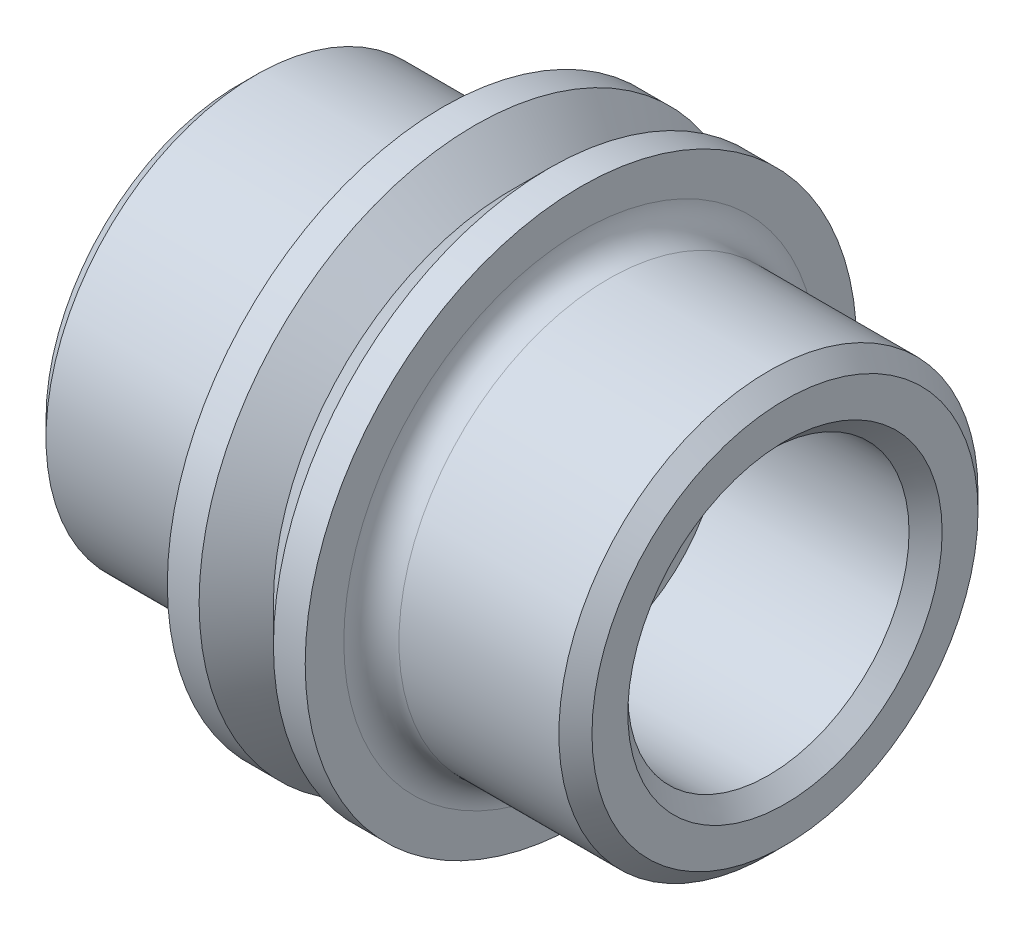
ISO-10303-21;
HEADER;
FILE_DESCRIPTION(('STEP AP214'),'2;1');
FILE_NAME('part.step','',(''),(''),'','','');
FILE_SCHEMA(('AUTOMOTIVE_DESIGN { 1 0 10303 214 1 1 1 1 }'));
ENDSEC;
DATA;
#1=APPLICATION_CONTEXT('core data for automotive mechanical design processes');
#2=APPLICATION_PROTOCOL_DEFINITION('international standard','automotive_design',2000,#1);
#3=PRODUCT_CONTEXT('',#1,'mechanical');
#4=PRODUCT('Part','Part','',(#3));
#5=PRODUCT_RELATED_PRODUCT_CATEGORY('part','',(#4));
#6=PRODUCT_DEFINITION_FORMATION('','',#4);
#7=PRODUCT_DEFINITION_CONTEXT('part definition',#1,'design');
#8=PRODUCT_DEFINITION('design','',#6,#7);
#9=PRODUCT_DEFINITION_SHAPE('','',#8);
#10=(LENGTH_UNIT() NAMED_UNIT(*) SI_UNIT(.MILLI.,.METRE.));
#11=(NAMED_UNIT(*) PLANE_ANGLE_UNIT() SI_UNIT($,.RADIAN.));
#12=(NAMED_UNIT(*) SI_UNIT($,.STERADIAN.) SOLID_ANGLE_UNIT());
#13=UNCERTAINTY_MEASURE_WITH_UNIT(LENGTH_MEASURE(1.E-05),#10,'distance_accuracy_value','');
#14=(GEOMETRIC_REPRESENTATION_CONTEXT(3) GLOBAL_UNCERTAINTY_ASSIGNED_CONTEXT((#13)) GLOBAL_UNIT_ASSIGNED_CONTEXT((#10,
#11,#12)) REPRESENTATION_CONTEXT('',''));
#15=CARTESIAN_POINT('',(0.,0.,0.));
#16=DIRECTION('',(0.,0.,1.));
#17=DIRECTION('',(1.,0.,0.));
#18=AXIS2_PLACEMENT_3D('',#15,#16,#17);
#19=CARTESIAN_POINT('',(1.5875,0.,0.));
#20=DIRECTION('',(-1.,0.,0.));
#21=DIRECTION('',(0.,0.,1.));
#22=AXIS2_PLACEMENT_3D('',#19,#20,#21);
#23=CYLINDRICAL_SURFACE('',#22,6.35);
#24=CARTESIAN_POINT('',(1.5875,0.,0.));
#25=DIRECTION('',(1.,0.,0.));
#26=DIRECTION('',(0.,0.,-1.));
#27=AXIS2_PLACEMENT_3D('',#24,#25,#26);
#28=CIRCLE('',#27,6.35);
#29=CARTESIAN_POINT('',(1.5875,0.,-6.35));
#30=VERTEX_POINT('',#29);
#31=EDGE_CURVE('E81',#30,#30,#28,.T.);
#32=ORIENTED_EDGE('',*,*,#31,.F.);
#33=EDGE_LOOP('',(#32));
#34=FACE_BOUND('',#33,.T.);
#35=CARTESIAN_POINT('',(0.855554581758606,0.,0.));
#36=DIRECTION('',(1.,0.,0.));
#37=DIRECTION('',(0.,0.,-1.));
#38=AXIS2_PLACEMENT_3D('',#35,#36,#37);
#39=CIRCLE('',#38,6.35);
#40=CARTESIAN_POINT('',(0.855554581758606,0.,6.35));
#41=VERTEX_POINT('',#40);
#42=EDGE_CURVE('E11',#41,#41,#39,.F.);
#43=ORIENTED_EDGE('',*,*,#42,.F.);
#44=EDGE_LOOP('',(#43));
#45=FACE_BOUND('',#44,.T.);
#46=ADVANCED_FACE('F41',(#34,#45),#23,.T.);
#47=CARTESIAN_POINT('',(1.5875,0.,0.));
#48=DIRECTION('',(1.,0.,0.));
#49=DIRECTION('',(0.,0.,-1.));
#50=AXIS2_PLACEMENT_3D('',#47,#48,#49);
#51=PLANE('',#50);
#52=CARTESIAN_POINT('',(1.5875,0.,0.));
#53=DIRECTION('',(1.,0.,0.));
#54=DIRECTION('',(0.,0.,-1.));
#55=AXIS2_PLACEMENT_3D('',#52,#53,#54);
#56=CIRCLE('',#55,5.461);
#57=CARTESIAN_POINT('',(1.5875,0.,-5.461));
#58=VERTEX_POINT('',#57);
#59=EDGE_CURVE('E131',#58,#58,#56,.F.);
#60=ORIENTED_EDGE('',*,*,#59,.T.);
#61=EDGE_LOOP('',(#60));
#62=FACE_BOUND('',#61,.T.);
#63=ORIENTED_EDGE('',*,*,#31,.T.);
#64=EDGE_LOOP('',(#63));
#65=FACE_BOUND('',#64,.T.);
#66=ADVANCED_FACE('F156',(#62,#65),#51,.T.);
#67=CARTESIAN_POINT('',(6.2865,0.,0.));
#68=DIRECTION('',(1.,0.,0.));
#69=DIRECTION('',(0.,0.,-1.));
#70=AXIS2_PLACEMENT_3D('',#67,#68,#69);
#71=PLANE('',#70);
#72=CARTESIAN_POINT('',(6.2865,0.,0.));
#73=DIRECTION('',(1.,0.,0.));
#74=DIRECTION('',(0.,0.,-1.));
#75=AXIS2_PLACEMENT_3D('',#72,#73,#74);
#76=CIRCLE('',#75,3.6195);
#77=CARTESIAN_POINT('',(6.2865,0.,-3.6195));
#78=VERTEX_POINT('',#77);
#79=EDGE_CURVE('E111',#78,#78,#76,.F.);
#80=ORIENTED_EDGE('',*,*,#79,.T.);
#81=EDGE_LOOP('',(#80));
#82=FACE_BOUND('',#81,.T.);
#83=CARTESIAN_POINT('',(6.2865,0.,0.));
#84=DIRECTION('',(1.,0.,0.));
#85=DIRECTION('',(0.,0.,-1.));
#86=AXIS2_PLACEMENT_3D('',#83,#84,#85);
#87=CIRCLE('',#86,4.445);
#88=CARTESIAN_POINT('',(6.2865,0.,-4.445));
#89=VERTEX_POINT('',#88);
#90=EDGE_CURVE('E107',#89,#89,#87,.T.);
#91=ORIENTED_EDGE('',*,*,#90,.T.);
#92=EDGE_LOOP('',(#91));
#93=FACE_BOUND('',#92,.T.);
#94=ADVANCED_FACE('F161',(#82,#93),#71,.T.);
#95=CARTESIAN_POINT('',(6.2865,0.,0.));
#96=DIRECTION('',(-1.,0.,0.));
#97=DIRECTION('',(0.,0.,1.));
#98=AXIS2_PLACEMENT_3D('',#95,#96,#97);
#99=CYLINDRICAL_SURFACE('',#98,4.826);
#100=CARTESIAN_POINT('',(2.2225,0.,0.));
#101=DIRECTION('',(1.,0.,0.));
#102=DIRECTION('',(0.,0.,-1.));
#103=AXIS2_PLACEMENT_3D('',#100,#101,#102);
#104=CIRCLE('',#103,4.826);
#105=CARTESIAN_POINT('',(2.2225,0.,-4.826));
#106=VERTEX_POINT('',#105);
#107=EDGE_CURVE('E135',#106,#106,#104,.T.);
#108=ORIENTED_EDGE('',*,*,#107,.T.);
#109=EDGE_LOOP('',(#108));
#110=FACE_BOUND('',#109,.T.);
#111=CARTESIAN_POINT('',(5.9055,0.,0.));
#112=DIRECTION('',(1.,0.,0.));
#113=DIRECTION('',(0.,0.,-1.));
#114=AXIS2_PLACEMENT_3D('',#111,#112,#113);
#115=CIRCLE('',#114,4.826);
#116=CARTESIAN_POINT('',(5.9055,0.,-4.826));
#117=VERTEX_POINT('',#116);
#118=EDGE_CURVE('E119',#117,#117,#115,.F.);
#119=ORIENTED_EDGE('',*,*,#118,.T.);
#120=EDGE_LOOP('',(#119));
#121=FACE_BOUND('',#120,.T.);
#122=ADVANCED_FACE('F171',(#110,#121),#99,.T.);
#123=CARTESIAN_POINT('',(6.2865,0.,0.));
#124=DIRECTION('',(-1.,0.,0.));
#125=DIRECTION('',(0.,0.,1.));
#126=AXIS2_PLACEMENT_3D('',#123,#124,#125);
#127=CYLINDRICAL_SURFACE('',#126,3.2385);
#128=CARTESIAN_POINT('',(5.9055,0.,0.));
#129=DIRECTION('',(1.,0.,0.));
#130=DIRECTION('',(0.,0.,-1.));
#131=AXIS2_PLACEMENT_3D('',#128,#129,#130);
#132=CIRCLE('',#131,3.2385);
#133=CARTESIAN_POINT('',(5.9055,0.,-3.2385));
#134=VERTEX_POINT('',#133);
#135=EDGE_CURVE('E103',#134,#134,#132,.T.);
#136=ORIENTED_EDGE('',*,*,#135,.T.);
#137=EDGE_LOOP('',(#136));
#138=FACE_BOUND('',#137,.T.);
#139=CARTESIAN_POINT('',(1.5875,0.,0.));
#140=DIRECTION('',(1.,0.,0.));
#141=DIRECTION('',(0.,0.,-1.));
#142=AXIS2_PLACEMENT_3D('',#139,#140,#141);
#143=CIRCLE('',#142,3.2385);
#144=CARTESIAN_POINT('',(1.5875,0.,-3.2385));
#145=VERTEX_POINT('',#144);
#146=EDGE_CURVE('E76',#145,#145,#143,.F.);
#147=ORIENTED_EDGE('',*,*,#146,.T.);
#148=EDGE_LOOP('',(#147));
#149=FACE_BOUND('',#148,.T.);
#150=ADVANCED_FACE('F177',(#138,#149),#127,.F.);
#151=ORIENTED_EDGE('',*,*,#146,.F.);
#152=EDGE_LOOP('',(#151));
#153=FACE_BOUND('',#152,.T.);
#154=ADVANCED_FACE('F164',(#153),#51,.T.);
#155=CARTESIAN_POINT('',(5.9055,0.,0.));
#156=DIRECTION('',(1.,0.,0.));
#157=DIRECTION('',(0.,0.,-1.));
#158=AXIS2_PLACEMENT_3D('',#155,#156,#157);
#159=CONICAL_SURFACE('',#158,3.2385,0.785398163397449);
#160=ORIENTED_EDGE('',*,*,#79,.F.);
#161=EDGE_LOOP('',(#160));
#162=FACE_BOUND('',#161,.T.);
#163=ORIENTED_EDGE('',*,*,#135,.F.);
#164=EDGE_LOOP('',(#163));
#165=FACE_BOUND('',#164,.T.);
#166=ADVANCED_FACE('F176',(#162,#165),#159,.F.);
#167=CARTESIAN_POINT('',(6.2865,0.,0.));
#168=DIRECTION('',(-1.,0.,0.));
#169=DIRECTION('',(0.,0.,1.));
#170=AXIS2_PLACEMENT_3D('',#167,#168,#169);
#171=CONICAL_SURFACE('',#170,4.445,0.785398163397445);
#172=ORIENTED_EDGE('',*,*,#118,.F.);
#173=EDGE_LOOP('',(#172));
#174=FACE_BOUND('',#173,.T.);
#175=ORIENTED_EDGE('',*,*,#90,.F.);
#176=EDGE_LOOP('',(#175));
#177=FACE_BOUND('',#176,.T.);
#178=ADVANCED_FACE('F183',(#174,#177),#171,.T.);
#179=CARTESIAN_POINT('',(2.2225,0.,0.));
#180=DIRECTION('',(1.,0.,0.));
#181=DIRECTION('',(0.,0.,-1.));
#182=AXIS2_PLACEMENT_3D('',#179,#180,#181);
#183=TOROIDAL_SURFACE('',#182,5.461,0.635);
#184=ORIENTED_EDGE('',*,*,#107,.F.);
#185=EDGE_LOOP('',(#184));
#186=FACE_BOUND('',#185,.T.);
#187=ORIENTED_EDGE('',*,*,#59,.F.);
#188=EDGE_LOOP('',(#187));
#189=FACE_BOUND('',#188,.T.);
#190=ADVANCED_FACE('F43',(#186,#189),#183,.F.);
#191=CARTESIAN_POINT('',(1.27,0.,0.));
#192=DIRECTION('',(1.,0.,0.));
#193=DIRECTION('',(0.,0.,-1.));
#194=AXIS2_PLACEMENT_3D('',#191,#192,#193);
#195=CONICAL_SURFACE('',#194,6.76444541824139,0.785398163397448);
#196=ORIENTED_EDGE('',*,*,#42,.T.);
#197=DIRECTION('',(-0.707106781186547,0.,-0.707106781186548));
#198=VECTOR('',#197,1.);
#199=CARTESIAN_POINT('',(0.,0.,5.49444541824139));
#200=LINE('',#199,#198);
#201=CARTESIAN_POINT('',(0.,0.,5.49444541824139));
#202=VERTEX_POINT('',#201);
#203=EDGE_CURVE('E56',#41,#202,#200,.T.);
#204=ORIENTED_EDGE('',*,*,#203,.T.);
#205=CARTESIAN_POINT('',(0.,0.,0.));
#206=DIRECTION('',(1.,0.,0.));
#207=DIRECTION('',(0.,0.,1.));
#208=AXIS2_PLACEMENT_3D('',#205,#206,#207);
#209=CIRCLE('',#208,5.49444541824139);
#210=EDGE_CURVE('E66',#202,#202,#209,.T.);
#211=ORIENTED_EDGE('',*,*,#210,.T.);
#212=ORIENTED_EDGE('',*,*,#203,.F.);
#213=EDGE_LOOP('',(#196,#204,#211,#212));
#214=FACE_BOUND('',#213,.T.);
#215=ADVANCED_FACE('F65',(#214),#195,.T.);
#216=CARTESIAN_POINT('',(0.,0.,0.));
#217=DIRECTION('',(-1.,0.,0.));
#218=DIRECTION('',(0.,0.,1.));
#219=AXIS2_PLACEMENT_3D('',#216,#217,#218);
#220=CONICAL_SURFACE('',#219,5.49444541824139,0.785398163397448);
#221=CARTESIAN_POINT('',(-0.855554581758606,0.,0.));
#222=DIRECTION('',(-1.,0.,0.));
#223=DIRECTION('',(0.,0.,1.));
#224=AXIS2_PLACEMENT_3D('',#221,#222,#223);
#225=CIRCLE('',#224,6.35);
#226=CARTESIAN_POINT('',(-0.855554581758606,0.,6.35));
#227=VERTEX_POINT('',#226);
#228=EDGE_CURVE('E50',#227,#227,#225,.F.);
#229=ORIENTED_EDGE('',*,*,#228,.T.);
#230=DIRECTION('',(-0.707106781186547,0.,0.707106781186548));
#231=VECTOR('',#230,1.);
#232=CARTESIAN_POINT('',(-1.27,0.,6.76444541824139));
#233=LINE('',#232,#231);
#234=EDGE_CURVE('E63',#202,#227,#233,.T.);
#235=ORIENTED_EDGE('',*,*,#234,.F.);
#236=ORIENTED_EDGE('',*,*,#210,.F.);
#237=ORIENTED_EDGE('',*,*,#234,.T.);
#238=EDGE_LOOP('',(#229,#235,#236,#237));
#239=FACE_BOUND('',#238,.T.);
#240=ADVANCED_FACE('F140',(#239),#220,.T.);
#241=CARTESIAN_POINT('',(-1.5875,0.,0.));
#242=DIRECTION('',(1.,0.,0.));
#243=DIRECTION('',(0.,0.,-1.));
#244=AXIS2_PLACEMENT_3D('',#241,#242,#243);
#245=PLANE('',#244);
#246=CARTESIAN_POINT('',(-1.5875,0.,0.));
#247=DIRECTION('',(1.,0.,0.));
#248=DIRECTION('',(0.,0.,-1.));
#249=AXIS2_PLACEMENT_3D('',#246,#247,#248);
#250=CIRCLE('',#249,3.2385);
#251=CARTESIAN_POINT('',(-1.5875,0.,-3.2385));
#252=VERTEX_POINT('',#251);
#253=EDGE_CURVE('E74',#252,#252,#250,.F.);
#254=ORIENTED_EDGE('',*,*,#253,.T.);
#255=EDGE_LOOP('',(#254));
#256=FACE_BOUND('',#255,.T.);
#257=ADVANCED_FACE('F153',(#256),#245,.F.);
#258=CARTESIAN_POINT('',(-5.9055,0.,0.));
#259=DIRECTION('',(1.,0.,0.));
#260=DIRECTION('',(0.,0.,-1.));
#261=AXIS2_PLACEMENT_3D('',#258,#259,#260);
#262=CIRCLE('',#261,3.2385);
#263=CARTESIAN_POINT('',(-5.9055,0.,-3.2385));
#264=VERTEX_POINT('',#263);
#265=EDGE_CURVE('E99',#264,#264,#262,.F.);
#266=ORIENTED_EDGE('',*,*,#265,.T.);
#267=EDGE_LOOP('',(#266));
#268=FACE_BOUND('',#267,.T.);
#269=ORIENTED_EDGE('',*,*,#253,.F.);
#270=EDGE_LOOP('',(#269));
#271=FACE_BOUND('',#270,.T.);
#272=ADVANCED_FACE('F188',(#268,#271),#127,.F.);
#273=CARTESIAN_POINT('',(-6.2865,0.,0.));
#274=DIRECTION('',(-1.,0.,0.));
#275=DIRECTION('',(0.,0.,1.));
#276=AXIS2_PLACEMENT_3D('',#273,#274,#275);
#277=CONICAL_SURFACE('',#276,3.6195,0.785398163397446);
#278=ORIENTED_EDGE('',*,*,#265,.F.);
#279=EDGE_LOOP('',(#278));
#280=FACE_BOUND('',#279,.T.);
#281=CARTESIAN_POINT('',(-6.2865,0.,0.));
#282=DIRECTION('',(1.,0.,0.));
#283=DIRECTION('',(0.,0.,-1.));
#284=AXIS2_PLACEMENT_3D('',#281,#282,#283);
#285=CIRCLE('',#284,3.6195);
#286=CARTESIAN_POINT('',(-6.2865,0.,-3.6195));
#287=VERTEX_POINT('',#286);
#288=EDGE_CURVE('E95',#287,#287,#285,.T.);
#289=ORIENTED_EDGE('',*,*,#288,.F.);
#290=EDGE_LOOP('',(#289));
#291=FACE_BOUND('',#290,.T.);
#292=ADVANCED_FACE('F198',(#280,#291),#277,.F.);
#293=CARTESIAN_POINT('',(-6.2865,0.,0.));
#294=DIRECTION('',(1.,0.,0.));
#295=DIRECTION('',(0.,0.,-1.));
#296=AXIS2_PLACEMENT_3D('',#293,#294,#295);
#297=PLANE('',#296);
#298=ORIENTED_EDGE('',*,*,#288,.T.);
#299=EDGE_LOOP('',(#298));
#300=FACE_BOUND('',#299,.T.);
#301=CARTESIAN_POINT('',(-6.2865,0.,0.));
#302=DIRECTION('',(1.,0.,0.));
#303=DIRECTION('',(0.,0.,-1.));
#304=AXIS2_PLACEMENT_3D('',#301,#302,#303);
#305=CIRCLE('',#304,4.445);
#306=CARTESIAN_POINT('',(-6.2865,0.,-4.445));
#307=VERTEX_POINT('',#306);
#308=EDGE_CURVE('E80',#307,#307,#305,.F.);
#309=ORIENTED_EDGE('',*,*,#308,.T.);
#310=EDGE_LOOP('',(#309));
#311=FACE_BOUND('',#310,.T.);
#312=ADVANCED_FACE('F204',(#300,#311),#297,.F.);
#313=CARTESIAN_POINT('',(-5.9055,0.,0.));
#314=DIRECTION('',(1.,0.,0.));
#315=DIRECTION('',(0.,0.,-1.));
#316=AXIS2_PLACEMENT_3D('',#313,#314,#315);
#317=CONICAL_SURFACE('',#316,4.826,0.785398163397448);
#318=ORIENTED_EDGE('',*,*,#308,.F.);
#319=EDGE_LOOP('',(#318));
#320=FACE_BOUND('',#319,.T.);
#321=CARTESIAN_POINT('',(-5.9055,0.,0.));
#322=DIRECTION('',(1.,0.,0.));
#323=DIRECTION('',(0.,0.,-1.));
#324=AXIS2_PLACEMENT_3D('',#321,#322,#323);
#325=CIRCLE('',#324,4.826);
#326=CARTESIAN_POINT('',(-5.9055,0.,-4.826));
#327=VERTEX_POINT('',#326);
#328=EDGE_CURVE('E115',#327,#327,#325,.T.);
#329=ORIENTED_EDGE('',*,*,#328,.F.);
#330=EDGE_LOOP('',(#329));
#331=FACE_BOUND('',#330,.T.);
#332=ADVANCED_FACE('F215',(#320,#331),#317,.T.);
#333=CARTESIAN_POINT('',(-2.2225,0.,0.));
#334=DIRECTION('',(1.,0.,0.));
#335=DIRECTION('',(0.,0.,-1.));
#336=AXIS2_PLACEMENT_3D('',#333,#334,#335);
#337=CIRCLE('',#336,4.826);
#338=CARTESIAN_POINT('',(-2.2225,0.,-4.826));
#339=VERTEX_POINT('',#338);
#340=EDGE_CURVE('E123',#339,#339,#337,.F.);
#341=ORIENTED_EDGE('',*,*,#340,.T.);
#342=EDGE_LOOP('',(#341));
#343=FACE_BOUND('',#342,.T.);
#344=ORIENTED_EDGE('',*,*,#328,.T.);
#345=EDGE_LOOP('',(#344));
#346=FACE_BOUND('',#345,.T.);
#347=ADVANCED_FACE('F195',(#343,#346),#99,.T.);
#348=CARTESIAN_POINT('',(-2.2225,0.,0.));
#349=DIRECTION('',(1.,0.,0.));
#350=DIRECTION('',(0.,0.,-1.));
#351=AXIS2_PLACEMENT_3D('',#348,#349,#350);
#352=TOROIDAL_SURFACE('',#351,5.461,0.635);
#353=CARTESIAN_POINT('',(-1.5875,0.,0.));
#354=DIRECTION('',(1.,0.,0.));
#355=DIRECTION('',(0.,0.,-1.));
#356=AXIS2_PLACEMENT_3D('',#353,#354,#355);
#357=CIRCLE('',#356,5.461);
#358=CARTESIAN_POINT('',(-1.5875,0.,-5.461));
#359=VERTEX_POINT('',#358);
#360=EDGE_CURVE('E127',#359,#359,#357,.T.);
#361=ORIENTED_EDGE('',*,*,#360,.F.);
#362=EDGE_LOOP('',(#361));
#363=FACE_BOUND('',#362,.T.);
#364=ORIENTED_EDGE('',*,*,#340,.F.);
#365=EDGE_LOOP('',(#364));
#366=FACE_BOUND('',#365,.T.);
#367=ADVANCED_FACE('F150',(#363,#366),#352,.F.);
#368=ORIENTED_EDGE('',*,*,#360,.T.);
#369=EDGE_LOOP('',(#368));
#370=FACE_BOUND('',#369,.T.);
#371=CARTESIAN_POINT('',(-1.5875,0.,0.));
#372=DIRECTION('',(1.,0.,0.));
#373=DIRECTION('',(0.,0.,-1.));
#374=AXIS2_PLACEMENT_3D('',#371,#372,#373);
#375=CIRCLE('',#374,6.35);
#376=CARTESIAN_POINT('',(-1.5875,0.,-6.35));
#377=VERTEX_POINT('',#376);
#378=EDGE_CURVE('E85',#377,#377,#375,.T.);
#379=ORIENTED_EDGE('',*,*,#378,.F.);
#380=EDGE_LOOP('',(#379));
#381=FACE_BOUND('',#380,.T.);
#382=ADVANCED_FACE('F144',(#370,#381),#245,.F.);
#383=ORIENTED_EDGE('',*,*,#378,.T.);
#384=EDGE_LOOP('',(#383));
#385=FACE_BOUND('',#384,.T.);
#386=ORIENTED_EDGE('',*,*,#228,.F.);
#387=EDGE_LOOP('',(#386));
#388=FACE_BOUND('',#387,.T.);
#389=ADVANCED_FACE('F142',(#385,#388),#23,.T.);
#390=CLOSED_SHELL('',(#46,#66,#94,#122,#150,#154,#166,#178,#190,#215,#240,#257,#272,#292,#312,
#332,#347,#367,#382,#389));
#391=MANIFOLD_SOLID_BREP('B2',#390);
#392=ADVANCED_BREP_SHAPE_REPRESENTATION('',(#18,#391),#14);
#393=SHAPE_DEFINITION_REPRESENTATION(#9,#392);
ENDSEC;
END-ISO-10303-21;
